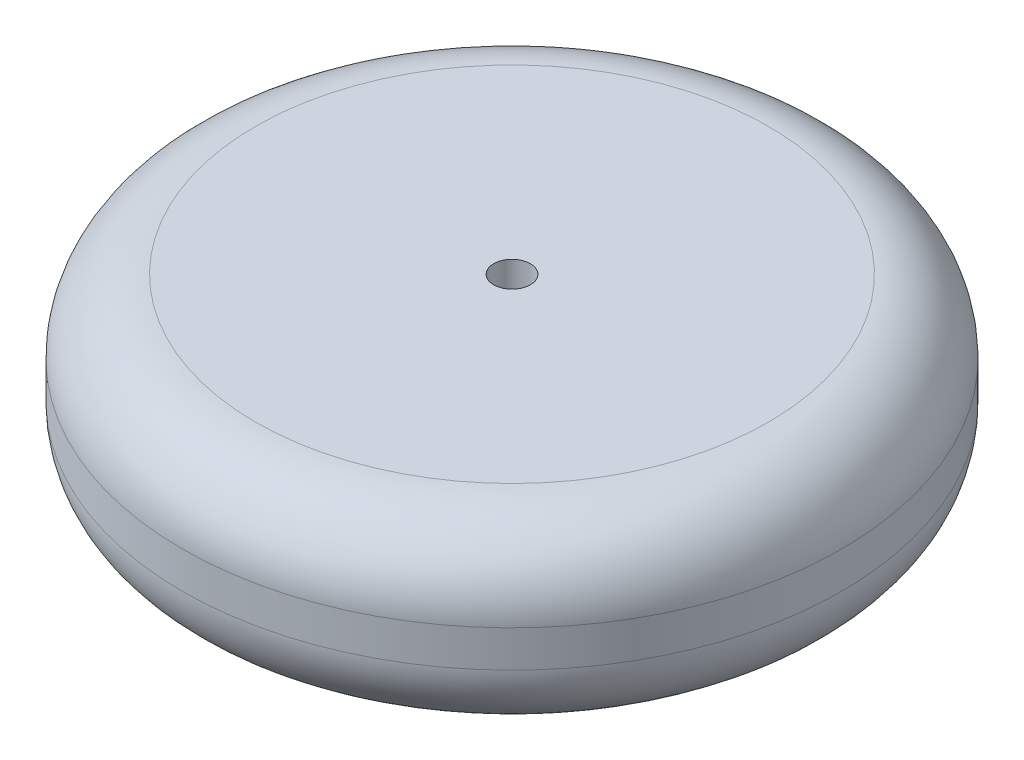
ISO-10303-21;
HEADER;
FILE_DESCRIPTION(('STEP AP214'),'2;1');
FILE_NAME('part.step','',(''),(''),'','','');
FILE_SCHEMA(('AUTOMOTIVE_DESIGN { 1 0 10303 214 1 1 1 1 }'));
ENDSEC;
DATA;
#1=APPLICATION_CONTEXT('core data for automotive mechanical design processes');
#2=APPLICATION_PROTOCOL_DEFINITION('international standard','automotive_design',2000,#1);
#3=PRODUCT_CONTEXT('',#1,'mechanical');
#4=PRODUCT('Part','Part','',(#3));
#5=PRODUCT_RELATED_PRODUCT_CATEGORY('part','',(#4));
#6=PRODUCT_DEFINITION_FORMATION('','',#4);
#7=PRODUCT_DEFINITION_CONTEXT('part definition',#1,'design');
#8=PRODUCT_DEFINITION('design','',#6,#7);
#9=PRODUCT_DEFINITION_SHAPE('','',#8);
#10=(LENGTH_UNIT() NAMED_UNIT(*) SI_UNIT(.MILLI.,.METRE.));
#11=(NAMED_UNIT(*) PLANE_ANGLE_UNIT() SI_UNIT($,.RADIAN.));
#12=(NAMED_UNIT(*) SI_UNIT($,.STERADIAN.) SOLID_ANGLE_UNIT());
#13=UNCERTAINTY_MEASURE_WITH_UNIT(LENGTH_MEASURE(1.E-05),#10,'distance_accuracy_value','');
#14=(GEOMETRIC_REPRESENTATION_CONTEXT(3) GLOBAL_UNCERTAINTY_ASSIGNED_CONTEXT((#13)) GLOBAL_UNIT_ASSIGNED_CONTEXT((#10,
#11,#12)) REPRESENTATION_CONTEXT('',''));
#15=CARTESIAN_POINT('',(0.,0.,0.));
#16=DIRECTION('',(0.,0.,1.));
#17=DIRECTION('',(1.,0.,0.));
#18=AXIS2_PLACEMENT_3D('',#15,#16,#17);
#19=CARTESIAN_POINT('',(0.,-31.75,0.));
#20=DIRECTION('',(0.,1.,0.));
#21=DIRECTION('',(0.,0.,1.));
#22=AXIS2_PLACEMENT_3D('',#19,#20,#21);
#23=CYLINDRICAL_SURFACE('',#22,114.3);
#24=CARTESIAN_POINT('',(0.,-6.35,0.));
#25=DIRECTION('',(0.,1.,0.));
#26=DIRECTION('',(0.,0.,1.));
#27=AXIS2_PLACEMENT_3D('',#24,#25,#26);
#28=CIRCLE('',#27,114.3);
#29=CARTESIAN_POINT('',(0.,-6.35,114.3));
#30=VERTEX_POINT('',#29);
#31=EDGE_CURVE('E43',#30,#30,#28,.T.);
#32=ORIENTED_EDGE('',*,*,#31,.T.);
#33=EDGE_LOOP('',(#32));
#34=FACE_BOUND('',#33,.T.);
#35=CARTESIAN_POINT('',(0.,6.35,0.));
#36=DIRECTION('',(0.,1.,0.));
#37=DIRECTION('',(0.,0.,1.));
#38=AXIS2_PLACEMENT_3D('',#35,#36,#37);
#39=CIRCLE('',#38,114.3);
#40=CARTESIAN_POINT('',(0.,6.35,114.3));
#41=VERTEX_POINT('',#40);
#42=EDGE_CURVE('E47',#41,#41,#39,.F.);
#43=ORIENTED_EDGE('',*,*,#42,.T.);
#44=EDGE_LOOP('',(#43));
#45=FACE_BOUND('',#44,.T.);
#46=ADVANCED_FACE('F32',(#34,#45),#23,.T.);
#47=CARTESIAN_POINT('',(0.,-31.75,0.));
#48=DIRECTION('',(0.,1.,0.));
#49=DIRECTION('',(0.,0.,1.));
#50=AXIS2_PLACEMENT_3D('',#47,#48,#49);
#51=PLANE('',#50);
#52=CARTESIAN_POINT('',(0.,-31.75,0.));
#53=DIRECTION('',(0.,1.,0.));
#54=DIRECTION('',(0.,0.,1.));
#55=AXIS2_PLACEMENT_3D('',#52,#53,#54);
#56=CIRCLE('',#55,6.35);
#57=CARTESIAN_POINT('',(0.,-31.75,6.35));
#58=VERTEX_POINT('',#57);
#59=EDGE_CURVE('E52',#58,#58,#56,.T.);
#60=ORIENTED_EDGE('',*,*,#59,.T.);
#61=EDGE_LOOP('',(#60));
#62=FACE_BOUND('',#61,.T.);
#63=CARTESIAN_POINT('',(0.,-31.75,0.));
#64=DIRECTION('',(0.,1.,0.));
#65=DIRECTION('',(0.,0.,1.));
#66=AXIS2_PLACEMENT_3D('',#63,#64,#65);
#67=CIRCLE('',#66,88.9);
#68=CARTESIAN_POINT('',(0.,-31.75,88.9));
#69=VERTEX_POINT('',#68);
#70=EDGE_CURVE('E39',#69,#69,#67,.F.);
#71=ORIENTED_EDGE('',*,*,#70,.T.);
#72=EDGE_LOOP('',(#71));
#73=FACE_BOUND('',#72,.T.);
#74=ADVANCED_FACE('F65',(#62,#73),#51,.F.);
#75=CARTESIAN_POINT('',(0.,31.75,0.));
#76=DIRECTION('',(0.,1.,0.));
#77=DIRECTION('',(0.,0.,1.));
#78=AXIS2_PLACEMENT_3D('',#75,#76,#77);
#79=PLANE('',#78);
#80=CARTESIAN_POINT('',(0.,31.75,0.));
#81=DIRECTION('',(0.,1.,0.));
#82=DIRECTION('',(0.,0.,1.));
#83=AXIS2_PLACEMENT_3D('',#80,#81,#82);
#84=CIRCLE('',#83,6.35);
#85=CARTESIAN_POINT('',(0.,31.75,6.35));
#86=VERTEX_POINT('',#85);
#87=EDGE_CURVE('E55',#86,#86,#84,.T.);
#88=ORIENTED_EDGE('',*,*,#87,.F.);
#89=EDGE_LOOP('',(#88));
#90=FACE_BOUND('',#89,.T.);
#91=CARTESIAN_POINT('',(0.,31.75,0.));
#92=DIRECTION('',(0.,1.,0.));
#93=DIRECTION('',(0.,0.,1.));
#94=AXIS2_PLACEMENT_3D('',#91,#92,#93);
#95=CIRCLE('',#94,88.9);
#96=CARTESIAN_POINT('',(0.,31.75,88.9));
#97=VERTEX_POINT('',#96);
#98=EDGE_CURVE('E10',#97,#97,#95,.T.);
#99=ORIENTED_EDGE('',*,*,#98,.T.);
#100=EDGE_LOOP('',(#99));
#101=FACE_BOUND('',#100,.T.);
#102=ADVANCED_FACE('F62',(#90,#101),#79,.T.);
#103=CARTESIAN_POINT('',(0.,-6.35,0.));
#104=DIRECTION('',(0.,1.,0.));
#105=DIRECTION('',(0.,0.,1.));
#106=AXIS2_PLACEMENT_3D('',#103,#104,#105);
#107=TOROIDAL_SURFACE('',#106,88.9,25.4);
#108=ORIENTED_EDGE('',*,*,#70,.F.);
#109=EDGE_LOOP('',(#108));
#110=FACE_BOUND('',#109,.T.);
#111=ORIENTED_EDGE('',*,*,#31,.F.);
#112=EDGE_LOOP('',(#111));
#113=FACE_BOUND('',#112,.T.);
#114=ADVANCED_FACE('F64',(#110,#113),#107,.T.);
#115=CARTESIAN_POINT('',(0.,6.35,0.));
#116=DIRECTION('',(0.,1.,0.));
#117=DIRECTION('',(0.,0.,1.));
#118=AXIS2_PLACEMENT_3D('',#115,#116,#117);
#119=TOROIDAL_SURFACE('',#118,88.9,25.4);
#120=ORIENTED_EDGE('',*,*,#42,.F.);
#121=EDGE_LOOP('',(#120));
#122=FACE_BOUND('',#121,.T.);
#123=ORIENTED_EDGE('',*,*,#98,.F.);
#124=EDGE_LOOP('',(#123));
#125=FACE_BOUND('',#124,.T.);
#126=ADVANCED_FACE('F34',(#122,#125),#119,.T.);
#127=CARTESIAN_POINT('',(0.,-75.438,0.));
#128=DIRECTION('',(0.,1.,0.));
#129=DIRECTION('',(0.,0.,1.));
#130=AXIS2_PLACEMENT_3D('',#127,#128,#129);
#131=CYLINDRICAL_SURFACE('',#130,6.35);
#132=ORIENTED_EDGE('',*,*,#87,.T.);
#133=EDGE_LOOP('',(#132));
#134=FACE_BOUND('',#133,.T.);
#135=ORIENTED_EDGE('',*,*,#59,.F.);
#136=EDGE_LOOP('',(#135));
#137=FACE_BOUND('',#136,.T.);
#138=ADVANCED_FACE('F59',(#134,#137),#131,.F.);
#139=CLOSED_SHELL('',(#46,#74,#102,#114,#126,#138));
#140=MANIFOLD_SOLID_BREP('B2',#139);
#141=ADVANCED_BREP_SHAPE_REPRESENTATION('',(#18,#140),#14);
#142=SHAPE_DEFINITION_REPRESENTATION(#9,#141);
ENDSEC;
END-ISO-10303-21;
